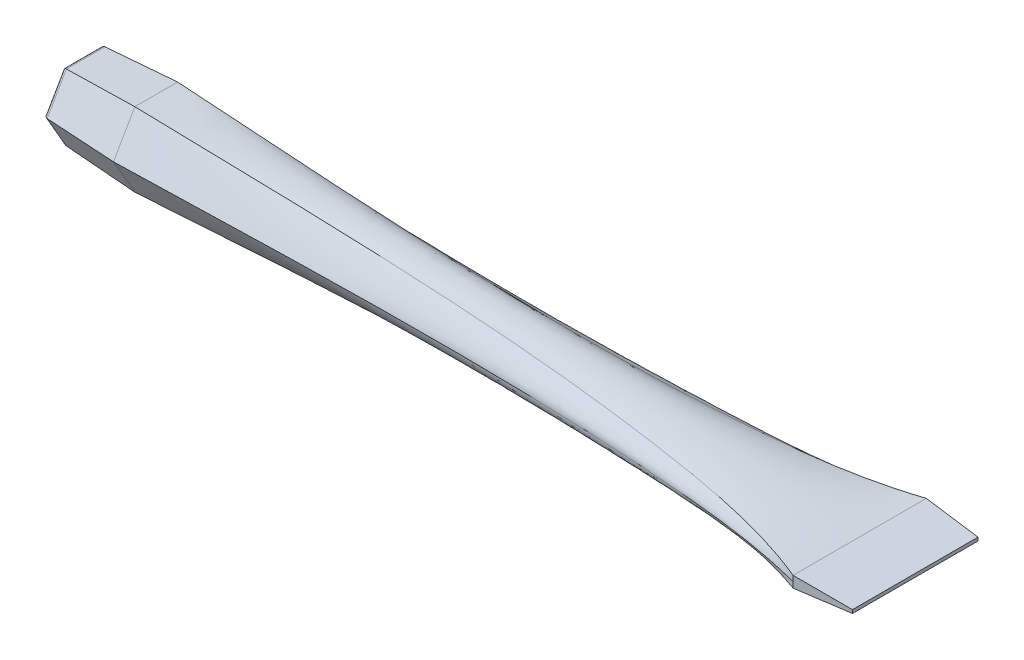
ISO-10303-21;
HEADER;
FILE_DESCRIPTION(('STEP AP214'),'2;1');
FILE_NAME('part.step','',(''),(''),'','','');
FILE_SCHEMA(('AUTOMOTIVE_DESIGN { 1 0 10303 214 1 1 1 1 }'));
ENDSEC;
DATA;
#1=APPLICATION_CONTEXT('core data for automotive mechanical design processes');
#2=APPLICATION_PROTOCOL_DEFINITION('international standard','automotive_design',2000,#1);
#3=PRODUCT_CONTEXT('',#1,'mechanical');
#4=PRODUCT('Part','Part','',(#3));
#5=PRODUCT_RELATED_PRODUCT_CATEGORY('part','',(#4));
#6=PRODUCT_DEFINITION_FORMATION('','',#4);
#7=PRODUCT_DEFINITION_CONTEXT('part definition',#1,'design');
#8=PRODUCT_DEFINITION('design','',#6,#7);
#9=PRODUCT_DEFINITION_SHAPE('','',#8);
#10=(LENGTH_UNIT() NAMED_UNIT(*) SI_UNIT(.MILLI.,.METRE.));
#11=(NAMED_UNIT(*) PLANE_ANGLE_UNIT() SI_UNIT($,.RADIAN.));
#12=(NAMED_UNIT(*) SI_UNIT($,.STERADIAN.) SOLID_ANGLE_UNIT());
#13=UNCERTAINTY_MEASURE_WITH_UNIT(LENGTH_MEASURE(1.E-05),#10,'distance_accuracy_value','');
#14=(GEOMETRIC_REPRESENTATION_CONTEXT(3) GLOBAL_UNCERTAINTY_ASSIGNED_CONTEXT((#13)) GLOBAL_UNIT_ASSIGNED_CONTEXT((#10,
#11,#12)) REPRESENTATION_CONTEXT('',''));
#15=CARTESIAN_POINT('',(0.,0.,0.));
#16=DIRECTION('',(0.,0.,1.));
#17=DIRECTION('',(1.,0.,0.));
#18=AXIS2_PLACEMENT_3D('',#15,#16,#17);
#19=CARTESIAN_POINT('',(0.,0.,11.5470053837925));
#20=CARTESIAN_POINT('',(50.0524857948005,0.,10.152627898497));
#21=CARTESIAN_POINT('',(114.191888216519,0.,7.717409430133));
#22=CARTESIAN_POINT('',(176.719152461467,0.,14.454624309302));
#23=CARTESIAN_POINT('',(190.,0.,18.));
#24=CARTESIAN_POINT('',(0.,-3.33333333333334,9.62250448649376));
#25=CARTESIAN_POINT('',(50.0807434546291,-2.58960922456807,8.34036333428904));
#26=CARTESIAN_POINT('',(114.135882131359,-1.9868860527801,8.94009763736227));
#27=CARTESIAN_POINT('',(176.747410121296,-0.700720335679182,13.9253603432932));
#28=CARTESIAN_POINT('',(190.,-0.500000000000002,18.));
#29=CARTESIAN_POINT('',(0.,-6.66666666666668,7.698003589195));
#30=CARTESIAN_POINT('',(50.1090011144577,-5.17921844913613,6.5280987700811));
#31=CARTESIAN_POINT('',(114.0798760462,-3.8493216600053,6.98155758950189));
#32=CARTESIAN_POINT('',(176.775667781124,-1.40144067135834,13.3960963772844));
#33=CARTESIAN_POINT('',(190.,-1.,18.));
#34=CARTESIAN_POINT('',(0.,-10.,5.77350269189624));
#35=CARTESIAN_POINT('',(50.1372587742863,-7.76882767370418,4.71583420587316));
#36=CARTESIAN_POINT('',(114.023869961041,-4.92835147361547,2.43953739263068));
#37=CARTESIAN_POINT('',(176.803925440953,-2.1021610070375,12.8668324112757));
#38=CARTESIAN_POINT('',(190.,-1.5,18.));
#39=B_SPLINE_SURFACE_WITH_KNOTS('',3,3,((#19,#20,#21,#22,#23),(#24,#25,#26,#27,#28),(#29,#30,
#31,#32,#33),(#34,#35,#36,#37,#38)),.UNSPECIFIED.,.F.,.F.,.F.,(4,4),(4,1,4),(0.,1.),(0.,
0.786925268887612,1.),.UNSPECIFIED.);
#40=DIRECTION('',(0.,-0.866025403784438,-0.500000000000001));
#41=VECTOR('',#40,1.);
#42=CARTESIAN_POINT('',(0.,0.,11.5470053837925));
#43=LINE('',#42,#41);
#44=CARTESIAN_POINT('',(0.,0.,11.5470053837925));
#45=VERTEX_POINT('',#44);
#46=CARTESIAN_POINT('',(0.,-10.,5.77350269189624));
#47=VERTEX_POINT('',#46);
#48=EDGE_CURVE('E188',#45,#47,#43,.T.);
#49=CARTESIAN_POINT('',(0.,-10.,5.77350269189624));
#50=CARTESIAN_POINT('',(50.1372587742863,-7.76882767370418,4.71583420587316));
#51=CARTESIAN_POINT('',(114.023869961041,-4.92835147361547,2.43953739263068));
#52=CARTESIAN_POINT('',(176.803925440953,-2.1021610070375,12.8668324112757));
#53=CARTESIAN_POINT('',(190.,-1.5,18.));
#54=B_SPLINE_CURVE_WITH_KNOTS('',3,(#49,#50,#51,#52,#53),.UNSPECIFIED.,.F.,.F.,(4,1,4),(0.,
0.786925268887612,1.),.UNSPECIFIED.);
#55=CARTESIAN_POINT('',(190.,-1.5,18.));
#56=VERTEX_POINT('',#55);
#57=EDGE_CURVE('E219',#47,#56,#54,.T.);
#58=DIRECTION('',(0.,-1.,0.));
#59=VECTOR('',#58,1.);
#60=CARTESIAN_POINT('',(190.,-1.5,18.));
#61=LINE('',#60,#59);
#62=CARTESIAN_POINT('',(190.,0.,18.));
#63=VERTEX_POINT('',#62);
#64=EDGE_CURVE('E217',#63,#56,#61,.T.);
#65=CARTESIAN_POINT('',(0.,0.,11.5470053837925));
#66=CARTESIAN_POINT('',(50.0524857948005,0.,10.152627898497));
#67=CARTESIAN_POINT('',(114.191888216519,0.,7.717409430133));
#68=CARTESIAN_POINT('',(176.719152461467,0.,14.454624309302));
#69=CARTESIAN_POINT('',(190.,0.,18.));
#70=B_SPLINE_CURVE_WITH_KNOTS('',3,(#65,#66,#67,#68,#69),.UNSPECIFIED.,.F.,.F.,(4,1,4),(0.,
0.786925268887612,1.),.UNSPECIFIED.);
#71=EDGE_CURVE('E207',#63,#45,#70,.F.);
#72=ORIENTED_EDGE('',*,*,#48,.T.);
#73=ORIENTED_EDGE('',*,*,#57,.T.);
#74=ORIENTED_EDGE('',*,*,#64,.F.);
#75=ORIENTED_EDGE('',*,*,#71,.T.);
#76=EDGE_LOOP('',(#72,#73,#74,#75));
#77=FACE_BOUND('',#76,.T.);
#78=ADVANCED_FACE('F75',(#77),#39,.T.);
#79=CARTESIAN_POINT('',(0.,-10.,5.77350269189624));
#80=CARTESIAN_POINT('',(50.1372587742863,-7.76882767370418,4.71583420587316));
#81=CARTESIAN_POINT('',(114.023869961041,-4.92835147361547,2.43953739263069));
#82=CARTESIAN_POINT('',(176.803925440953,-2.1021610070375,12.8668324112757));
#83=CARTESIAN_POINT('',(190.,-1.5,18.));
#84=CARTESIAN_POINT('',(0.,-10.,5.29237746757155));
#85=CARTESIAN_POINT('',(50.1173549026115,-7.93798023263459,4.41725436959057));
#86=CARTESIAN_POINT('',(114.063319014458,-5.3953873633319,2.58748183779831));
#87=CARTESIAN_POINT('',(176.784021569278,-2.27131356596791,11.8890027245429));
#88=CARTESIAN_POINT('',(190.,-1.5,16.5));
#89=CARTESIAN_POINT('',(0.,-10.,4.33012701892217));
#90=CARTESIAN_POINT('',(50.0775471592618,-8.2762853504954,3.8200946970254));
#91=CARTESIAN_POINT('',(114.142217121291,-6.15790110732661,2.49949383465914));
#92=CARTESIAN_POINT('',(176.744213825929,-2.60961868382872,9.93334335107729));
#93=CARTESIAN_POINT('',(190.,-1.5,13.5));
#94=CARTESIAN_POINT('',(0.,-10.,2.40562612162341));
#95=CARTESIAN_POINT('',(50.0356832500862,-8.7446797768169,2.29121854053671));
#96=CARTESIAN_POINT('',(114.225190505381,-7.35240675599341,1.87035221919841));
#97=CARTESIAN_POINT('',(176.702349916753,-3.07801311015022,5.68746779278776));
#98=CARTESIAN_POINT('',(190.,-1.5,7.5));
#99=CARTESIAN_POINT('',(0.,-9.99999999999999,0.));
#100=CARTESIAN_POINT('',(50.0186474363684,-9.00799071015255,-0.00032548337492733));
#101=CARTESIAN_POINT('',(114.258955128481,-7.98233038199574,-0.000825329718279294));
#102=CARTESIAN_POINT('',(176.685314103035,-3.34132404348587,-0.000325483374897683));
#103=CARTESIAN_POINT('',(190.,-1.5,0.));
#104=CARTESIAN_POINT('',(0.,-10.,-2.40562612162348));
#105=CARTESIAN_POINT('',(50.0356933414434,-8.74473720505391,-2.290587571826));
#106=CARTESIAN_POINT('',(114.225170504523,-7.35254870712392,-1.86873682059862));
#107=CARTESIAN_POINT('',(176.70236000811,-3.07807053838724,-5.68683682407701));
#108=CARTESIAN_POINT('',(190.,-1.5,-7.5));
#109=CARTESIAN_POINT('',(0.,-9.99999999999998,-4.33012701892224));
#110=CARTESIAN_POINT('',(50.0775459811206,-8.27629377709764,-3.82019822009271));
#111=CARTESIAN_POINT('',(114.142219456343,-6.15792748057584,-2.49982203523417));
#112=CARTESIAN_POINT('',(176.744212647787,-2.60962711043097,-9.93344687414455));
#113=CARTESIAN_POINT('',(190.,-1.5,-13.5));
#114=CARTESIAN_POINT('',(0.,-9.99999999999998,-5.29237746757162));
#115=CARTESIAN_POINT('',(50.1173545098978,-7.93798304150199,-4.4172888772797));
#116=CARTESIAN_POINT('',(114.063319792808,-5.39538179621599,-2.58741344428714));
#117=CARTESIAN_POINT('',(176.784021176564,-2.27131637483533,-11.889037232232));
#118=CARTESIAN_POINT('',(190.,-1.5,-16.5));
#119=CARTESIAN_POINT('',(0.,-9.99999999999998,-5.77350269189631));
#120=CARTESIAN_POINT('',(50.1372587742863,-7.76882767370416,-4.7158342058732));
#121=CARTESIAN_POINT('',(114.023869961041,-4.92835147361547,-2.43953739263069));
#122=CARTESIAN_POINT('',(176.803925440953,-2.10216100703751,-12.8668324112757));
#123=CARTESIAN_POINT('',(190.,-1.5,-18.));
#124=B_SPLINE_SURFACE_WITH_KNOTS('',3,3,((#79,#80,#81,#82,#83),(#84,#85,#86,#87,#88),(#89,#90,
#91,#92,#93),(#94,#95,#96,#97,#98),(#99,#100,#101,#102,#103),(#104,#105,#106,#107,#108),(#109,
#110,#111,#112,#113),(#114,#115,#116,#117,#118),(#119,#120,#121,#122,#123)),.UNSPECIFIED.,.F.,
.F.,.F.,(4,1,1,1,1,1,4),(4,1,4),(0.,0.125,0.25,0.5,0.75,0.875,1.),(0.,0.786925268887612,1.),.UNSPECIFIED.);
#125=DIRECTION('',(0.,0.,-1.));
#126=VECTOR('',#125,1.);
#127=CARTESIAN_POINT('',(0.,-10.,5.77350269189624));
#128=LINE('',#127,#126);
#129=CARTESIAN_POINT('',(0.,-9.99999999999998,-5.77350269189631));
#130=VERTEX_POINT('',#129);
#131=EDGE_CURVE('E199',#47,#130,#128,.T.);
#132=CARTESIAN_POINT('',(0.,-9.99999999999998,-5.77350269189631));
#133=CARTESIAN_POINT('',(50.1372587742863,-7.76882767370416,-4.7158342058732));
#134=CARTESIAN_POINT('',(114.023869961041,-4.92835147361547,-2.43953739263069));
#135=CARTESIAN_POINT('',(176.803925440953,-2.10216100703751,-12.8668324112757));
#136=CARTESIAN_POINT('',(190.,-1.5,-18.));
#137=B_SPLINE_CURVE_WITH_KNOTS('',3,(#132,#133,#134,#135,#136),.UNSPECIFIED.,.F.,.F.,(4,1,4),
(0.,0.786925268887612,1.),.UNSPECIFIED.);
#138=CARTESIAN_POINT('',(190.,-1.5,-18.));
#139=VERTEX_POINT('',#138);
#140=EDGE_CURVE('E222',#130,#139,#137,.T.);
#141=DIRECTION('',(0.,0.,-1.));
#142=VECTOR('',#141,1.);
#143=CARTESIAN_POINT('',(190.,-1.5,-18.));
#144=LINE('',#143,#142);
#145=EDGE_CURVE('E279',#56,#139,#144,.T.);
#146=ORIENTED_EDGE('',*,*,#131,.T.);
#147=ORIENTED_EDGE('',*,*,#140,.T.);
#148=ORIENTED_EDGE('',*,*,#145,.F.);
#149=ORIENTED_EDGE('',*,*,#57,.F.);
#150=EDGE_LOOP('',(#146,#147,#148,#149));
#151=FACE_BOUND('',#150,.T.);
#152=ADVANCED_FACE('F252',(#151),#124,.T.);
#153=CARTESIAN_POINT('',(0.,9.99999999999994,5.77350269189638));
#154=CARTESIAN_POINT('',(50.1372587742863,7.76882767370414,4.71583420587323));
#155=CARTESIAN_POINT('',(114.023869961041,4.92835147361547,2.43953739263067));
#156=CARTESIAN_POINT('',(176.803925440953,2.10216100703751,12.8668324112757));
#157=CARTESIAN_POINT('',(190.,1.5,18.));
#158=CARTESIAN_POINT('',(0.,6.66666666666663,7.69800358919509));
#159=CARTESIAN_POINT('',(50.1090011144577,5.17921844913609,6.52809877008115));
#160=CARTESIAN_POINT('',(114.0798760462,3.84932166000529,6.98155758950199));
#161=CARTESIAN_POINT('',(176.775667781124,1.40144067135833,13.3960963772844));
#162=CARTESIAN_POINT('',(190.,0.999999999999999,18.));
#163=CARTESIAN_POINT('',(0.,3.33333333333331,9.62250448649381));
#164=CARTESIAN_POINT('',(50.0807434546291,2.58960922456803,8.34036333428907));
#165=CARTESIAN_POINT('',(114.135882131359,1.98688605278004,8.94009763736238));
#166=CARTESIAN_POINT('',(176.747410121296,0.700720335679157,13.9253603432932));
#167=CARTESIAN_POINT('',(190.,0.499999999999999,18.));
#168=CARTESIAN_POINT('',(0.,0.,11.5470053837925));
#169=CARTESIAN_POINT('',(50.0524857948005,0.,10.152627898497));
#170=CARTESIAN_POINT('',(114.191888216519,0.,7.717409430133));
#171=CARTESIAN_POINT('',(176.719152461467,0.,14.454624309302));
#172=CARTESIAN_POINT('',(190.,0.,18.));
#173=B_SPLINE_SURFACE_WITH_KNOTS('',3,3,((#153,#154,#155,#156,#157),(#158,#159,#160,#161,#162),
(#163,#164,#165,#166,#167),(#168,#169,#170,#171,#172)),.UNSPECIFIED.,.F.,.F.,.F.,(4,4),(4,1,4),
(0.,1.),(0.,0.786925268887612,1.),.UNSPECIFIED.);
#174=DIRECTION('',(0.,-0.866025403784442,0.499999999999995));
#175=VECTOR('',#174,1.);
#176=CARTESIAN_POINT('',(0.,9.99999999999994,5.77350269189638));
#177=LINE('',#176,#175);
#178=CARTESIAN_POINT('',(0.,9.99999999999994,5.77350269189638));
#179=VERTEX_POINT('',#178);
#180=EDGE_CURVE('E179',#179,#45,#177,.T.);
#181=DIRECTION('',(0.,-1.,0.));
#182=VECTOR('',#181,1.);
#183=CARTESIAN_POINT('',(190.,0.,18.));
#184=LINE('',#183,#182);
#185=CARTESIAN_POINT('',(190.,1.5,18.));
#186=VERTEX_POINT('',#185);
#187=EDGE_CURVE('E425',#186,#63,#184,.T.);
#188=CARTESIAN_POINT('',(0.,9.99999999999994,5.77350269189638));
#189=CARTESIAN_POINT('',(50.1372587742863,7.76882767370414,4.71583420587323));
#190=CARTESIAN_POINT('',(114.023869961041,4.92835147361547,2.43953739263068));
#191=CARTESIAN_POINT('',(176.803925440953,2.10216100703751,12.8668324112756));
#192=CARTESIAN_POINT('',(190.,1.5,18.));
#193=B_SPLINE_CURVE_WITH_KNOTS('',3,(#188,#189,#190,#191,#192),.UNSPECIFIED.,.F.,.F.,(4,1,4),
(0.,0.786925268887612,1.),.UNSPECIFIED.);
#194=EDGE_CURVE('E210',#179,#186,#193,.T.);
#195=ORIENTED_EDGE('',*,*,#180,.T.);
#196=ORIENTED_EDGE('',*,*,#71,.F.);
#197=ORIENTED_EDGE('',*,*,#187,.F.);
#198=ORIENTED_EDGE('',*,*,#194,.F.);
#199=EDGE_LOOP('',(#195,#196,#197,#198));
#200=FACE_BOUND('',#199,.T.);
#201=ADVANCED_FACE('F206',(#200),#173,.T.);
#202=CARTESIAN_POINT('',(0.,-9.99999999999998,-5.77350269189631));
#203=CARTESIAN_POINT('',(50.1372587742863,-7.76882767370416,-4.7158342058732));
#204=CARTESIAN_POINT('',(114.023869961041,-4.92835147361547,-2.4395373926307));
#205=CARTESIAN_POINT('',(176.803925440953,-2.10216100703751,-12.8668324112757));
#206=CARTESIAN_POINT('',(190.,-1.5,-18.));
#207=CARTESIAN_POINT('',(0.,-6.66666666666663,-7.69800358919505));
#208=CARTESIAN_POINT('',(50.1090011144577,-5.17921844913609,-6.52809877008113));
#209=CARTESIAN_POINT('',(114.0798760462,-3.8493216600053,-6.98155758950194));
#210=CARTESIAN_POINT('',(176.775667781124,-1.40144067135834,-13.3960963772844));
#211=CARTESIAN_POINT('',(190.,-0.999999999999996,-18.));
#212=CARTESIAN_POINT('',(0.,-3.33333333333327,-9.62250448649378));
#213=CARTESIAN_POINT('',(50.0807434546291,-2.58960922456802,-8.34036333428906));
#214=CARTESIAN_POINT('',(114.135882131359,-1.98688605278007,-8.94009763736234));
#215=CARTESIAN_POINT('',(176.747410121296,-0.700720335679171,-13.9253603432932));
#216=CARTESIAN_POINT('',(190.,-0.499999999999996,-18.));
#217=CARTESIAN_POINT('',(0.,0.,-11.5470053837925));
#218=CARTESIAN_POINT('',(50.0524857948005,0.,-10.152627898497));
#219=CARTESIAN_POINT('',(114.191888216519,0.,-7.717409430133));
#220=CARTESIAN_POINT('',(176.719152461467,0.,-14.454624309302));
#221=CARTESIAN_POINT('',(190.,0.,-18.));
#222=B_SPLINE_SURFACE_WITH_KNOTS('',3,3,((#202,#203,#204,#205,#206),(#207,#208,#209,#210,#211),
(#212,#213,#214,#215,#216),(#217,#218,#219,#220,#221)),.UNSPECIFIED.,.F.,.F.,.F.,(4,4),(4,1,4),
(0.,1.),(0.,0.786925268887612,1.),.UNSPECIFIED.);
#223=DIRECTION('',(0.,0.866025403784441,-0.499999999999995));
#224=VECTOR('',#223,1.);
#225=CARTESIAN_POINT('',(0.,-9.99999999999998,-5.77350269189631));
#226=LINE('',#225,#224);
#227=CARTESIAN_POINT('',(0.,0.,-11.5470053837925));
#228=VERTEX_POINT('',#227);
#229=EDGE_CURVE('E759',#130,#228,#226,.T.);
#230=CARTESIAN_POINT('',(0.,0.,-11.5470053837925));
#231=CARTESIAN_POINT('',(50.0524857948005,0.,-10.152627898497));
#232=CARTESIAN_POINT('',(114.191888216519,0.,-7.717409430133));
#233=CARTESIAN_POINT('',(176.719152461467,0.,-14.454624309302));
#234=CARTESIAN_POINT('',(190.,0.,-18.));
#235=B_SPLINE_CURVE_WITH_KNOTS('',3,(#230,#231,#232,#233,#234),.UNSPECIFIED.,.F.,.F.,(4,1,4),
(0.,0.786925268887612,1.),.UNSPECIFIED.);
#236=CARTESIAN_POINT('',(190.,0.,-18.));
#237=VERTEX_POINT('',#236);
#238=EDGE_CURVE('E331',#228,#237,#235,.T.);
#239=DIRECTION('',(0.,1.,0.));
#240=VECTOR('',#239,1.);
#241=CARTESIAN_POINT('',(190.,-1.5,-18.));
#242=LINE('',#241,#240);
#243=EDGE_CURVE('E292',#139,#237,#242,.T.);
#244=ORIENTED_EDGE('',*,*,#229,.T.);
#245=ORIENTED_EDGE('',*,*,#238,.T.);
#246=ORIENTED_EDGE('',*,*,#243,.F.);
#247=ORIENTED_EDGE('',*,*,#140,.F.);
#248=EDGE_LOOP('',(#244,#245,#246,#247));
#249=FACE_BOUND('',#248,.T.);
#250=ADVANCED_FACE('F299',(#249),#222,.T.);
#251=CARTESIAN_POINT('',(0.,0.,-11.5470053837925));
#252=CARTESIAN_POINT('',(50.0524857948005,0.,-10.152627898497));
#253=CARTESIAN_POINT('',(114.191888216519,0.,-7.717409430133));
#254=CARTESIAN_POINT('',(176.719152461467,0.,-14.454624309302));
#255=CARTESIAN_POINT('',(190.,0.,-18.));
#256=CARTESIAN_POINT('',(0.,3.33333333333341,-9.62250448649374));
#257=CARTESIAN_POINT('',(50.0807434546291,2.5896092245681,-8.34036333428903));
#258=CARTESIAN_POINT('',(114.135882131359,1.98688605278007,-8.94009763736233));
#259=CARTESIAN_POINT('',(176.747410121296,0.700720335679165,-13.9253603432932));
#260=CARTESIAN_POINT('',(190.,0.500000000000004,-18.));
#261=CARTESIAN_POINT('',(0.,6.66666666666673,-7.69800358919495));
#262=CARTESIAN_POINT('',(50.1090011144577,5.17921844913615,-6.52809877008107));
#263=CARTESIAN_POINT('',(114.0798760462,3.8493216600053,-6.98155758950194));
#264=CARTESIAN_POINT('',(176.775667781124,1.40144067135833,-13.3960963772844));
#265=CARTESIAN_POINT('',(190.,1.,-18.));
#266=CARTESIAN_POINT('',(0.,10.0000000000001,-5.77350269189617));
#267=CARTESIAN_POINT('',(50.1372587742863,7.76882767370421,-4.71583420587311));
#268=CARTESIAN_POINT('',(114.023869961041,4.92835147361547,-2.43953739263068));
#269=CARTESIAN_POINT('',(176.803925440953,2.1021610070375,-12.8668324112757));
#270=CARTESIAN_POINT('',(190.,1.5,-18.));
#271=B_SPLINE_SURFACE_WITH_KNOTS('',3,3,((#251,#252,#253,#254,#255),(#256,#257,#258,#259,#260),
(#261,#262,#263,#264,#265),(#266,#267,#268,#269,#270)),.UNSPECIFIED.,.F.,.F.,.F.,(4,4),(4,1,4),
(0.,1.),(0.,0.786925268887612,1.),.UNSPECIFIED.);
#272=DIRECTION('',(0.,0.866025403784435,0.500000000000007));
#273=VECTOR('',#272,1.);
#274=CARTESIAN_POINT('',(0.,0.,-11.5470053837925));
#275=LINE('',#274,#273);
#276=CARTESIAN_POINT('',(0.,10.0000000000001,-5.77350269189617));
#277=VERTEX_POINT('',#276);
#278=EDGE_CURVE('E224',#228,#277,#275,.T.);
#279=CARTESIAN_POINT('',(0.,10.0000000000001,-5.77350269189617));
#280=CARTESIAN_POINT('',(50.1372587742863,7.76882767370421,-4.71583420587311));
#281=CARTESIAN_POINT('',(114.023869961041,4.92835147361547,-2.43953739263068));
#282=CARTESIAN_POINT('',(176.803925440953,2.1021610070375,-12.8668324112757));
#283=CARTESIAN_POINT('',(190.,1.5,-18.));
#284=B_SPLINE_CURVE_WITH_KNOTS('',3,(#279,#280,#281,#282,#283),.UNSPECIFIED.,.F.,.F.,(4,1,4),
(0.,0.786925268887612,1.),.UNSPECIFIED.);
#285=CARTESIAN_POINT('',(190.,1.5,-18.));
#286=VERTEX_POINT('',#285);
#287=EDGE_CURVE('E338',#277,#286,#284,.T.);
#288=DIRECTION('',(0.,1.,0.));
#289=VECTOR('',#288,1.);
#290=CARTESIAN_POINT('',(190.,0.,-18.));
#291=LINE('',#290,#289);
#292=EDGE_CURVE('E363',#237,#286,#291,.T.);
#293=ORIENTED_EDGE('',*,*,#278,.T.);
#294=ORIENTED_EDGE('',*,*,#287,.T.);
#295=ORIENTED_EDGE('',*,*,#292,.F.);
#296=ORIENTED_EDGE('',*,*,#238,.F.);
#297=EDGE_LOOP('',(#293,#294,#295,#296));
#298=FACE_BOUND('',#297,.T.);
#299=ADVANCED_FACE('F310',(#298),#271,.T.);
#300=CARTESIAN_POINT('',(0.,10.0000000000001,-5.77350269189617));
#301=CARTESIAN_POINT('',(50.1372587742863,7.76882767370421,-4.71583420587311));
#302=CARTESIAN_POINT('',(114.023869961041,4.92835147361547,-2.43953739263069));
#303=CARTESIAN_POINT('',(176.803925440953,2.1021610070375,-12.8668324112757));
#304=CARTESIAN_POINT('',(190.,1.5,-18.));
#305=CARTESIAN_POINT('',(0.,10.0000000000001,-5.29237746757148));
#306=CARTESIAN_POINT('',(50.1173549026115,7.93798023263461,-4.41725436959053));
#307=CARTESIAN_POINT('',(114.063319014458,5.3953873633319,-2.58748183779831));
#308=CARTESIAN_POINT('',(176.784021569278,2.27131356596791,-11.8890027245429));
#309=CARTESIAN_POINT('',(190.,1.5,-16.5));
#310=CARTESIAN_POINT('',(0.,10.,-4.3301270189221));
#311=CARTESIAN_POINT('',(50.0775471592618,8.27628535049543,-3.82009469702535));
#312=CARTESIAN_POINT('',(114.142217121292,6.15790110732663,-2.49949383465917));
#313=CARTESIAN_POINT('',(176.744213825929,2.60961868382873,-9.93334335107728));
#314=CARTESIAN_POINT('',(190.,1.5,-13.5));
#315=CARTESIAN_POINT('',(0.,10.,-2.40562612162334));
#316=CARTESIAN_POINT('',(50.0356832500862,8.74467977681689,-2.29121854053667));
#317=CARTESIAN_POINT('',(114.22519050538,7.35240675599339,-1.87035221919838));
#318=CARTESIAN_POINT('',(176.702349916753,3.07801311015021,-5.68746779278778));
#319=CARTESIAN_POINT('',(190.,1.5,-7.49999999999999));
#320=CARTESIAN_POINT('',(0.,10.,1.02348685082632E-13));
#321=CARTESIAN_POINT('',(50.0186474363684,9.00799071015255,0.000325483374969926));
#322=CARTESIAN_POINT('',(114.258955128481,7.98233038199576,0.000825329718274401));
#323=CARTESIAN_POINT('',(176.685314103035,3.34132404348589,0.000325483374907015));
#324=CARTESIAN_POINT('',(190.,1.5,0.));
#325=CARTESIAN_POINT('',(0.,9.99999999999998,2.40562612162355));
#326=CARTESIAN_POINT('',(50.0356933414434,8.74473720505389,2.29058757182603));
#327=CARTESIAN_POINT('',(114.225170504523,7.3525487071239,1.86873682059858));
#328=CARTESIAN_POINT('',(176.70236000811,3.07807053838724,5.686836824077));
#329=CARTESIAN_POINT('',(190.,1.5,7.50000000000001));
#330=CARTESIAN_POINT('',(0.,9.99999999999995,4.33012701892231));
#331=CARTESIAN_POINT('',(50.0775459811206,8.27629377709761,3.82019822009275));
#332=CARTESIAN_POINT('',(114.142219456342,6.15792748057586,2.49982203523412));
#333=CARTESIAN_POINT('',(176.744212647787,2.60962711043098,9.93344687414457));
#334=CARTESIAN_POINT('',(190.,1.5,13.5));
#335=CARTESIAN_POINT('',(0.,9.99999999999994,5.29237746757169));
#336=CARTESIAN_POINT('',(50.1173545098978,7.93798304150196,4.41728887727974));
#337=CARTESIAN_POINT('',(114.063319792808,5.39538179621599,2.58741344428713));
#338=CARTESIAN_POINT('',(176.784021176564,2.27131637483533,11.8890372322319));
#339=CARTESIAN_POINT('',(190.,1.5,16.5));
#340=CARTESIAN_POINT('',(0.,9.99999999999994,5.77350269189638));
#341=CARTESIAN_POINT('',(50.1372587742863,7.76882767370414,4.71583420587323));
#342=CARTESIAN_POINT('',(114.023869961041,4.92835147361547,2.43953739263068));
#343=CARTESIAN_POINT('',(176.803925440953,2.10216100703751,12.8668324112756));
#344=CARTESIAN_POINT('',(190.,1.5,18.));
#345=B_SPLINE_SURFACE_WITH_KNOTS('',3,3,((#300,#301,#302,#303,#304),(#305,#306,#307,#308,#309),
(#310,#311,#312,#313,#314),(#315,#316,#317,#318,#319),(#320,#321,#322,#323,#324),(#325,#326,
#327,#328,#329),(#330,#331,#332,#333,#334),(#335,#336,#337,#338,#339),(#340,#341,#342,#343,
#344)),.UNSPECIFIED.,.F.,.F.,.F.,(4,1,1,1,1,1,4),(4,1,4),(0.,0.125,0.25,0.5,0.75,0.875,1.),(0.,
0.786925268887612,1.),.UNSPECIFIED.);
#346=DIRECTION('',(0.,0.,1.));
#347=VECTOR('',#346,1.);
#348=CARTESIAN_POINT('',(0.,10.0000000000001,-5.77350269189617));
#349=LINE('',#348,#347);
#350=EDGE_CURVE('E220',#277,#179,#349,.T.);
#351=DIRECTION('',(0.,0.,1.));
#352=VECTOR('',#351,1.);
#353=CARTESIAN_POINT('',(190.,1.5,-18.));
#354=LINE('',#353,#352);
#355=EDGE_CURVE('E376',#286,#186,#354,.T.);
#356=ORIENTED_EDGE('',*,*,#350,.T.);
#357=ORIENTED_EDGE('',*,*,#194,.T.);
#358=ORIENTED_EDGE('',*,*,#355,.F.);
#359=ORIENTED_EDGE('',*,*,#287,.F.);
#360=EDGE_LOOP('',(#356,#357,#358,#359));
#361=FACE_BOUND('',#360,.T.);
#362=ADVANCED_FACE('F380',(#361),#345,.T.);
#363=CARTESIAN_POINT('',(190.,1.5,-18.));
#364=DIRECTION('',(0.0697564737441255,0.997564050259824,0.));
#365=DIRECTION('',(-0.997564050259824,0.0697564737441255,0.));
#366=AXIS2_PLACEMENT_3D('',#363,#364,#365);
#367=PLANE('',#366);
#368=ORIENTED_EDGE('',*,*,#355,.T.);
#369=DIRECTION('',(-0.995145815783508,0.0695873743166648,0.0695873743166648));
#370=VECTOR('',#369,1.);
#371=CARTESIAN_POINT('',(190.103874376574,1.49273639600357,17.9927363960036));
#372=LINE('',#371,#370);
#373=CARTESIAN_POINT('',(205.,0.451097820847341,16.9510978208473));
#374=VERTEX_POINT('',#373);
#375=EDGE_CURVE('E457',#374,#186,#372,.T.);
#376=ORIENTED_EDGE('',*,*,#375,.F.);
#377=DIRECTION('',(0.,0.,-1.));
#378=VECTOR('',#377,1.);
#379=CARTESIAN_POINT('',(205.,0.451097820847345,-18.));
#380=LINE('',#379,#378);
#381=CARTESIAN_POINT('',(205.,0.451097820847345,-16.9510978208473));
#382=VERTEX_POINT('',#381);
#383=EDGE_CURVE('E530',#382,#374,#380,.F.);
#384=ORIENTED_EDGE('',*,*,#383,.F.);
#385=DIRECTION('',(-0.995145815783508,0.0695873743166648,-0.0695873743166648));
#386=VECTOR('',#385,1.);
#387=CARTESIAN_POINT('',(190.,1.5,-18.));
#388=LINE('',#387,#386);
#389=EDGE_CURVE('E212',#382,#286,#388,.T.);
#390=ORIENTED_EDGE('',*,*,#389,.T.);
#391=EDGE_LOOP('',(#368,#376,#384,#390));
#392=FACE_BOUND('',#391,.T.);
#393=ADVANCED_FACE('F391',(#392),#367,.T.);
#394=CARTESIAN_POINT('',(190.,0.,18.));
#395=DIRECTION('',(0.0697564737441255,0.,0.997564050259824));
#396=DIRECTION('',(0.997564050259824,0.,-0.0697564737441255));
#397=AXIS2_PLACEMENT_3D('',#394,#395,#396);
#398=PLANE('',#397);
#399=ORIENTED_EDGE('',*,*,#187,.T.);
#400=ORIENTED_EDGE('',*,*,#64,.T.);
#401=DIRECTION('',(-0.995145815783508,-0.0695873743166648,0.0695873743166648));
#402=VECTOR('',#401,1.);
#403=CARTESIAN_POINT('',(190.,-1.5,18.));
#404=LINE('',#403,#402);
#405=CARTESIAN_POINT('',(205.,-0.451097820847343,16.9510978208473));
#406=VERTEX_POINT('',#405);
#407=EDGE_CURVE('E454',#406,#56,#404,.T.);
#408=ORIENTED_EDGE('',*,*,#407,.F.);
#409=DIRECTION('',(0.,1.,0.));
#410=VECTOR('',#409,1.);
#411=CARTESIAN_POINT('',(205.,0.,16.9510978208473));
#412=LINE('',#411,#410);
#413=EDGE_CURVE('E532',#374,#406,#412,.F.);
#414=ORIENTED_EDGE('',*,*,#413,.F.);
#415=ORIENTED_EDGE('',*,*,#375,.T.);
#416=EDGE_LOOP('',(#399,#400,#408,#414,#415));
#417=FACE_BOUND('',#416,.T.);
#418=ADVANCED_FACE('F253',(#417),#398,.T.);
#419=CARTESIAN_POINT('',(190.,-1.5,18.));
#420=DIRECTION('',(0.0697564737441255,-0.997564050259824,0.));
#421=DIRECTION('',(0.997564050259824,0.0697564737441255,0.));
#422=AXIS2_PLACEMENT_3D('',#419,#420,#421);
#423=PLANE('',#422);
#424=ORIENTED_EDGE('',*,*,#145,.T.);
#425=DIRECTION('',(-0.995145815783508,-0.0695873743166648,-0.0695873743166648));
#426=VECTOR('',#425,1.);
#427=CARTESIAN_POINT('',(190.,-1.5,-18.));
#428=LINE('',#427,#426);
#429=CARTESIAN_POINT('',(205.,-0.451097820847337,-16.9510978208473));
#430=VERTEX_POINT('',#429);
#431=EDGE_CURVE('E458',#430,#139,#428,.T.);
#432=ORIENTED_EDGE('',*,*,#431,.F.);
#433=DIRECTION('',(0.,0.,1.));
#434=VECTOR('',#433,1.);
#435=CARTESIAN_POINT('',(205.,-0.451097820847343,18.));
#436=LINE('',#435,#434);
#437=EDGE_CURVE('E522',#406,#430,#436,.F.);
#438=ORIENTED_EDGE('',*,*,#437,.F.);
#439=ORIENTED_EDGE('',*,*,#407,.T.);
#440=EDGE_LOOP('',(#424,#432,#438,#439));
#441=FACE_BOUND('',#440,.T.);
#442=ADVANCED_FACE('F505',(#441),#423,.T.);
#443=CARTESIAN_POINT('',(190.,-1.5,-18.));
#444=DIRECTION('',(0.0697564737441255,0.,-0.997564050259824));
#445=DIRECTION('',(-0.997564050259824,0.,-0.0697564737441255));
#446=AXIS2_PLACEMENT_3D('',#443,#444,#445);
#447=PLANE('',#446);
#448=ORIENTED_EDGE('',*,*,#243,.T.);
#449=ORIENTED_EDGE('',*,*,#292,.T.);
#450=ORIENTED_EDGE('',*,*,#389,.F.);
#451=DIRECTION('',(0.,-1.,0.));
#452=VECTOR('',#451,1.);
#453=CARTESIAN_POINT('',(205.,-1.5,-16.9510978208473));
#454=LINE('',#453,#452);
#455=EDGE_CURVE('E184',#430,#382,#454,.F.);
#456=ORIENTED_EDGE('',*,*,#455,.F.);
#457=ORIENTED_EDGE('',*,*,#431,.T.);
#458=EDGE_LOOP('',(#448,#449,#450,#456,#457));
#459=FACE_BOUND('',#458,.T.);
#460=ADVANCED_FACE('F496',(#459),#447,.T.);
#461=CARTESIAN_POINT('',(205.,0.,0.));
#462=DIRECTION('',(1.,0.,0.));
#463=DIRECTION('',(0.,0.,-1.));
#464=AXIS2_PLACEMENT_3D('',#461,#462,#463);
#465=PLANE('',#464);
#466=ORIENTED_EDGE('',*,*,#455,.T.);
#467=ORIENTED_EDGE('',*,*,#383,.T.);
#468=ORIENTED_EDGE('',*,*,#413,.T.);
#469=ORIENTED_EDGE('',*,*,#437,.T.);
#470=EDGE_LOOP('',(#466,#467,#468,#469));
#471=FACE_BOUND('',#470,.T.);
#472=ADVANCED_FACE('F504',(#471),#465,.T.);
#473=CARTESIAN_POINT('',(0.,-10.,5.77350269189624));
#474=DIRECTION('',(-0.0523359562429439,-0.499314767377288,0.864838546066895));
#475=DIRECTION('',(0.,-0.866025403784438,-0.500000000000001));
#476=AXIS2_PLACEMENT_3D('',#473,#474,#475);
#477=PLANE('',#476);
#478=DIRECTION('',(0.99817396359918,0.,0.0604047878293016));
#479=VECTOR('',#478,1.);
#480=CARTESIAN_POINT('',(0.,0.,11.5470053837925));
#481=LINE('',#480,#479);
#482=CARTESIAN_POINT('',(-19.0523359562429,0.,10.3940477300588));
#483=VERTEX_POINT('',#482);
#484=EDGE_CURVE('E175',#483,#45,#481,.T.);
#485=ORIENTED_EDGE('',*,*,#484,.F.);
#486=DIRECTION('',(0.,0.866025403784438,0.500000000000001));
#487=VECTOR('',#486,1.);
#488=CARTESIAN_POINT('',(-19.0523359562429,-8.97667689835904,5.21136090636287));
#489=LINE('',#488,#487);
#490=CARTESIAN_POINT('',(-19.0523359562429,-9.00150938237889,5.19702386502936));
#491=VERTEX_POINT('',#490);
#492=EDGE_CURVE('E12',#483,#491,#489,.F.);
#493=ORIENTED_EDGE('',*,*,#492,.T.);
#494=DIRECTION('',(0.99817396359918,-0.0523120807703845,0.0302023939146507));
#495=VECTOR('',#494,1.);
#496=CARTESIAN_POINT('',(0.,-10.,5.77350269189624));
#497=LINE('',#496,#495);
#498=EDGE_CURVE('E192',#491,#47,#497,.T.);
#499=ORIENTED_EDGE('',*,*,#498,.T.);
#500=ORIENTED_EDGE('',*,*,#48,.F.);
#501=EDGE_LOOP('',(#485,#493,#499,#500));
#502=FACE_BOUND('',#501,.T.);
#503=ADVANCED_FACE('F190',(#502),#477,.T.);
#504=CARTESIAN_POINT('',(0.,0.,11.5470053837925));
#505=DIRECTION('',(-0.0523359562429439,0.499314767377282,0.864838546066899));
#506=DIRECTION('',(0.,-0.866025403784441,0.499999999999995));
#507=AXIS2_PLACEMENT_3D('',#504,#505,#506);
#508=PLANE('',#507);
#509=DIRECTION('',(0.99817396359918,0.052312080770384,0.0302023939146512));
#510=VECTOR('',#509,1.);
#511=CARTESIAN_POINT('',(0.,9.99999999999994,5.77350269189638));
#512=LINE('',#511,#510);
#513=CARTESIAN_POINT('',(-19.0523359562429,9.00150938237881,5.1970238650295));
#514=VERTEX_POINT('',#513);
#515=EDGE_CURVE('E185',#514,#179,#512,.T.);
#516=ORIENTED_EDGE('',*,*,#515,.F.);
#517=DIRECTION('',(0.,0.866025403784442,-0.499999999999995));
#518=VECTOR('',#517,1.);
#519=CARTESIAN_POINT('',(-19.0523359562429,0.0248324840198509,10.3797106887253));
#520=LINE('',#519,#518);
#521=EDGE_CURVE('E84',#514,#483,#520,.F.);
#522=ORIENTED_EDGE('',*,*,#521,.T.);
#523=ORIENTED_EDGE('',*,*,#484,.T.);
#524=ORIENTED_EDGE('',*,*,#180,.F.);
#525=EDGE_LOOP('',(#516,#522,#523,#524));
#526=FACE_BOUND('',#525,.T.);
#527=ADVANCED_FACE('F177',(#526),#508,.T.);
#528=CARTESIAN_POINT('',(0.,9.99999999999994,5.77350269189638));
#529=DIRECTION('',(-0.0523359562429439,0.998629534754574,0.));
#530=DIRECTION('',(-0.998629534754574,-0.052335956242944,0.));
#531=AXIS2_PLACEMENT_3D('',#528,#529,#530);
#532=PLANE('',#531);
#533=DIRECTION('',(0.99817396359918,0.0523120807703847,-0.0302023939146504));
#534=VECTOR('',#533,1.);
#535=CARTESIAN_POINT('',(0.,10.0000000000001,-5.77350269189617));
#536=LINE('',#535,#534);
#537=CARTESIAN_POINT('',(-19.0523359562429,9.00150938237892,-5.1970238650293));
#538=VERTEX_POINT('',#537);
#539=EDGE_CURVE('E764',#538,#277,#536,.T.);
#540=ORIENTED_EDGE('',*,*,#539,.F.);
#541=DIRECTION('',(0.,0.,-1.));
#542=VECTOR('',#541,1.);
#543=CARTESIAN_POINT('',(-19.0523359562429,9.00150938237881,5.16834978236248));
#544=LINE('',#543,#542);
#545=EDGE_CURVE('E99',#538,#514,#544,.F.);
#546=ORIENTED_EDGE('',*,*,#545,.T.);
#547=ORIENTED_EDGE('',*,*,#515,.T.);
#548=ORIENTED_EDGE('',*,*,#350,.F.);
#549=EDGE_LOOP('',(#540,#546,#547,#548));
#550=FACE_BOUND('',#549,.T.);
#551=ADVANCED_FACE('F625',(#550),#532,.T.);
#552=CARTESIAN_POINT('',(0.,10.0000000000001,-5.77350269189617));
#553=DIRECTION('',(-0.0523359562429439,0.499314767377294,-0.864838546066892));
#554=DIRECTION('',(0.,0.866025403784435,0.500000000000007));
#555=AXIS2_PLACEMENT_3D('',#552,#553,#554);
#556=PLANE('',#555);
#557=DIRECTION('',(0.99817396359918,0.,-0.0604047878293017));
#558=VECTOR('',#557,1.);
#559=CARTESIAN_POINT('',(0.,0.,-11.5470053837925));
#560=LINE('',#559,#558);
#561=CARTESIAN_POINT('',(-19.0523359562429,0.,-10.3940477300588));
#562=VERTEX_POINT('',#561);
#563=EDGE_CURVE('E762',#562,#228,#560,.T.);
#564=ORIENTED_EDGE('',*,*,#563,.F.);
#565=DIRECTION('',(0.,-0.866025403784435,-0.500000000000007));
#566=VECTOR('',#565,1.);
#567=CARTESIAN_POINT('',(-19.0523359562429,8.97667689835907,-5.21136090636281));
#568=LINE('',#567,#566);
#569=EDGE_CURVE('E754',#562,#538,#568,.F.);
#570=ORIENTED_EDGE('',*,*,#569,.T.);
#571=ORIENTED_EDGE('',*,*,#539,.T.);
#572=ORIENTED_EDGE('',*,*,#278,.F.);
#573=EDGE_LOOP('',(#564,#570,#571,#572));
#574=FACE_BOUND('',#573,.T.);
#575=ADVANCED_FACE('F632',(#574),#556,.T.);
#576=CARTESIAN_POINT('',(0.,0.,-11.5470053837925));
#577=DIRECTION('',(-0.0523359562429439,-0.499314767377282,-0.864838546066899));
#578=DIRECTION('',(0.,0.866025403784441,-0.499999999999995));
#579=AXIS2_PLACEMENT_3D('',#576,#577,#578);
#580=PLANE('',#579);
#581=DIRECTION('',(0.99817396359918,-0.0523120807703842,-0.0302023939146511));
#582=VECTOR('',#581,1.);
#583=CARTESIAN_POINT('',(0.,-9.99999999999998,-5.77350269189631));
#584=LINE('',#583,#582);
#585=CARTESIAN_POINT('',(-19.0523359562429,-9.00150938237885,-5.19702386502943));
#586=VERTEX_POINT('',#585);
#587=EDGE_CURVE('E756',#586,#130,#584,.T.);
#588=ORIENTED_EDGE('',*,*,#587,.F.);
#589=DIRECTION('',(0.,-0.866025403784442,0.499999999999995));
#590=VECTOR('',#589,1.);
#591=CARTESIAN_POINT('',(-19.0523359562429,-0.0248324840197761,-10.3797106887253));
#592=LINE('',#591,#590);
#593=EDGE_CURVE('E749',#586,#562,#592,.F.);
#594=ORIENTED_EDGE('',*,*,#593,.T.);
#595=ORIENTED_EDGE('',*,*,#563,.T.);
#596=ORIENTED_EDGE('',*,*,#229,.F.);
#597=EDGE_LOOP('',(#588,#594,#595,#596));
#598=FACE_BOUND('',#597,.T.);
#599=ADVANCED_FACE('F639',(#598),#580,.T.);
#600=CARTESIAN_POINT('',(0.,-9.99999999999998,-5.77350269189631));
#601=DIRECTION('',(-0.0523359562429439,-0.998629534754574,0.));
#602=DIRECTION('',(0.998629534754574,-0.052335956242944,0.));
#603=AXIS2_PLACEMENT_3D('',#600,#601,#602);
#604=PLANE('',#603);
#605=ORIENTED_EDGE('',*,*,#498,.F.);
#606=DIRECTION('',(0.,0.,1.));
#607=VECTOR('',#606,1.);
#608=CARTESIAN_POINT('',(-19.0523359562429,-9.00150938237885,-5.16834978236241));
#609=LINE('',#608,#607);
#610=EDGE_CURVE('E740',#491,#586,#609,.F.);
#611=ORIENTED_EDGE('',*,*,#610,.T.);
#612=ORIENTED_EDGE('',*,*,#587,.T.);
#613=ORIENTED_EDGE('',*,*,#131,.F.);
#614=EDGE_LOOP('',(#605,#611,#612,#613));
#615=FACE_BOUND('',#614,.T.);
#616=ADVANCED_FACE('F647',(#615),#604,.T.);
#617=CARTESIAN_POINT('',(-20.,0.,0.));
#618=DIRECTION('',(-1.,0.,0.));
#619=DIRECTION('',(0.,0.,1.));
#620=AXIS2_PLACEMENT_3D('',#617,#618,#619);
#621=PLANE('',#620);
#622=DIRECTION('',(0.,0.866025403784441,-0.499999999999995));
#623=VECTOR('',#622,1.);
#624=CARTESIAN_POINT('',(-20.,-8.47736213098172,-4.34652236029603));
#625=LINE('',#624,#623);
#626=CARTESIAN_POINT('',(-20.,0.,-9.24092966863624));
#627=VERTEX_POINT('',#626);
#628=CARTESIAN_POINT('',(-20.,-8.00287984762428,-4.62046483431816));
#629=VERTEX_POINT('',#628);
#630=EDGE_CURVE('E796',#627,#629,#625,.F.);
#631=ORIENTED_EDGE('',*,*,#630,.T.);
#632=DIRECTION('',(0.,0.,-1.));
#633=VECTOR('',#632,1.);
#634=CARTESIAN_POINT('',(-20.,-8.00287984762431,5.16834978236235));
#635=LINE('',#634,#633);
#636=CARTESIAN_POINT('',(-20.,-8.00287984762431,4.6204648343181));
#637=VERTEX_POINT('',#636);
#638=EDGE_CURVE('E743',#629,#637,#635,.F.);
#639=ORIENTED_EDGE('',*,*,#638,.T.);
#640=DIRECTION('',(0.,-0.866025403784438,-0.500000000000001));
#641=VECTOR('',#640,1.);
#642=CARTESIAN_POINT('',(-20.,0.474482283357444,9.51487214265837));
#643=LINE('',#642,#641);
#644=CARTESIAN_POINT('',(-20.,0.,9.24092966863625));
#645=VERTEX_POINT('',#644);
#646=EDGE_CURVE('E788',#637,#645,#643,.F.);
#647=ORIENTED_EDGE('',*,*,#646,.T.);
#648=DIRECTION('',(0.,-0.866025403784441,0.499999999999995));
#649=VECTOR('',#648,1.);
#650=CARTESIAN_POINT('',(-20.,8.47736213098168,4.3465223602961));
#651=LINE('',#650,#649);
#652=CARTESIAN_POINT('',(-20.,8.00287984762425,4.62046483431822));
#653=VERTEX_POINT('',#652);
#654=EDGE_CURVE('E790',#645,#653,#651,.F.);
#655=ORIENTED_EDGE('',*,*,#654,.T.);
#656=DIRECTION('',(0.,0.,1.));
#657=VECTOR('',#656,1.);
#658=CARTESIAN_POINT('',(-20.,8.00287984762435,-5.1683497823623));
#659=LINE('',#658,#657);
#660=CARTESIAN_POINT('',(-20.,8.00287984762434,-4.62046483431805));
#661=VERTEX_POINT('',#660);
#662=EDGE_CURVE('E792',#653,#661,#659,.F.);
#663=ORIENTED_EDGE('',*,*,#662,.T.);
#664=DIRECTION('',(0.,0.866025403784435,0.500000000000007));
#665=VECTOR('',#664,1.);
#666=CARTESIAN_POINT('',(-20.,-0.474482283357376,-9.51487214265837));
#667=LINE('',#666,#665);
#668=EDGE_CURVE('E794',#661,#627,#667,.F.);
#669=ORIENTED_EDGE('',*,*,#668,.T.);
#670=EDGE_LOOP('',(#631,#639,#647,#655,#663,#669));
#671=FACE_BOUND('',#670,.T.);
#672=ADVANCED_FACE('F655',(#671),#621,.T.);
#673=CARTESIAN_POINT('',(-19.,8.00287984762429,0.));
#674=DIRECTION('',(0.,0.,-1.));
#675=DIRECTION('',(0.,1.,0.));
#676=AXIS2_PLACEMENT_3D('',#673,#674,#675);
#677=CYLINDRICAL_SURFACE('',#676,1.);
#678=CARTESIAN_POINT('',(-19.,8.00287984762425,4.62046483431822));
#679=DIRECTION('',(0.,0.500000000000007,-0.866025403784435));
#680=DIRECTION('',(0.,0.866025403784435,0.500000000000007));
#681=AXIS2_PLACEMENT_3D('',#678,#679,#680);
#682=ELLIPSE('',#681,1.15470053837925,1.);
#683=EDGE_CURVE('E804',#514,#653,#682,.F.);
#684=ORIENTED_EDGE('',*,*,#683,.F.);
#685=ORIENTED_EDGE('',*,*,#545,.F.);
#686=CARTESIAN_POINT('',(-19.,8.00287984762434,-4.62046483431804));
#687=DIRECTION('',(0.,-0.499999999999992,-0.866025403784443));
#688=DIRECTION('',(0.,0.866025403784443,-0.499999999999992));
#689=AXIS2_PLACEMENT_3D('',#686,#687,#688);
#690=ELLIPSE('',#689,1.15470053837925,1.);
#691=EDGE_CURVE('E79',#661,#538,#690,.T.);
#692=ORIENTED_EDGE('',*,*,#691,.F.);
#693=ORIENTED_EDGE('',*,*,#662,.F.);
#694=EDGE_LOOP('',(#684,#685,#692,#693));
#695=FACE_BOUND('',#694,.T.);
#696=ADVANCED_FACE('F77',(#695),#677,.T.);
#697=CARTESIAN_POINT('',(-19.,4.0014399238122,-6.93069725147714));
#698=DIRECTION('',(0.,-0.866025403784435,-0.500000000000007));
#699=DIRECTION('',(0.,0.500000000000007,-0.866025403784435));
#700=AXIS2_PLACEMENT_3D('',#697,#698,#699);
#701=CYLINDRICAL_SURFACE('',#700,1.);
#702=ORIENTED_EDGE('',*,*,#691,.T.);
#703=ORIENTED_EDGE('',*,*,#569,.F.);
#704=CARTESIAN_POINT('',(-19.,0.,-9.24092966863624));
#705=DIRECTION('',(0.,-1.,0.));
#706=DIRECTION('',(0.,0.,-1.));
#707=AXIS2_PLACEMENT_3D('',#704,#705,#706);
#708=ELLIPSE('',#707,1.15470053837925,1.);
#709=EDGE_CURVE('E751',#627,#562,#708,.T.);
#710=ORIENTED_EDGE('',*,*,#709,.F.);
#711=ORIENTED_EDGE('',*,*,#668,.F.);
#712=EDGE_LOOP('',(#702,#703,#710,#711));
#713=FACE_BOUND('',#712,.T.);
#714=ADVANCED_FACE('F670',(#713),#701,.T.);
#715=CARTESIAN_POINT('',(-19.,4.00143992381213,6.93069725147723));
#716=DIRECTION('',(0.,0.866025403784441,-0.499999999999995));
#717=DIRECTION('',(0.,0.499999999999995,0.866025403784442));
#718=AXIS2_PLACEMENT_3D('',#715,#716,#717);
#719=CYLINDRICAL_SURFACE('',#718,1.);
#720=ORIENTED_EDGE('',*,*,#683,.T.);
#721=ORIENTED_EDGE('',*,*,#654,.F.);
#722=CARTESIAN_POINT('',(-19.,0.,9.24092966863625));
#723=DIRECTION('',(0.,1.,0.));
#724=DIRECTION('',(0.,0.,1.));
#725=AXIS2_PLACEMENT_3D('',#722,#723,#724);
#726=ELLIPSE('',#725,1.15470053837925,1.);
#727=EDGE_CURVE('E745',#483,#645,#726,.F.);
#728=ORIENTED_EDGE('',*,*,#727,.F.);
#729=ORIENTED_EDGE('',*,*,#521,.F.);
#730=EDGE_LOOP('',(#720,#721,#728,#729));
#731=FACE_BOUND('',#730,.T.);
#732=ADVANCED_FACE('F677',(#731),#719,.T.);
#733=CARTESIAN_POINT('',(-19.,-4.00143992381211,-6.9306972514772));
#734=DIRECTION('',(0.,-0.866025403784441,0.499999999999995));
#735=DIRECTION('',(0.,-0.499999999999995,-0.866025403784441));
#736=AXIS2_PLACEMENT_3D('',#733,#734,#735);
#737=CYLINDRICAL_SURFACE('',#736,1.);
#738=ORIENTED_EDGE('',*,*,#709,.T.);
#739=ORIENTED_EDGE('',*,*,#593,.F.);
#740=CARTESIAN_POINT('',(-19.,-8.00287984762428,-4.62046483431816));
#741=DIRECTION('',(0.,-0.500000000000004,0.866025403784436));
#742=DIRECTION('',(0.,-0.866025403784436,-0.500000000000004));
#743=AXIS2_PLACEMENT_3D('',#740,#741,#742);
#744=ELLIPSE('',#743,1.15470053837925,1.);
#745=EDGE_CURVE('E737',#629,#586,#744,.T.);
#746=ORIENTED_EDGE('',*,*,#745,.F.);
#747=ORIENTED_EDGE('',*,*,#630,.F.);
#748=EDGE_LOOP('',(#738,#739,#746,#747));
#749=FACE_BOUND('',#748,.T.);
#750=ADVANCED_FACE('F684',(#749),#737,.T.);
#751=CARTESIAN_POINT('',(-19.,-4.00143992381216,6.93069725147717));
#752=DIRECTION('',(0.,0.866025403784438,0.500000000000001));
#753=DIRECTION('',(0.,-0.500000000000001,0.866025403784438));
#754=AXIS2_PLACEMENT_3D('',#751,#752,#753);
#755=CYLINDRICAL_SURFACE('',#754,1.);
#756=ORIENTED_EDGE('',*,*,#727,.T.);
#757=ORIENTED_EDGE('',*,*,#646,.F.);
#758=CARTESIAN_POINT('',(-19.,-8.00287984762431,4.6204648343181));
#759=DIRECTION('',(0.,0.499999999999998,0.86602540378444));
#760=DIRECTION('',(0.,0.86602540378444,-0.499999999999998));
#761=AXIS2_PLACEMENT_3D('',#758,#759,#760);
#762=ELLIPSE('',#761,1.15470053837925,1.);
#763=EDGE_CURVE('E746',#491,#637,#762,.F.);
#764=ORIENTED_EDGE('',*,*,#763,.F.);
#765=ORIENTED_EDGE('',*,*,#492,.F.);
#766=EDGE_LOOP('',(#756,#757,#764,#765));
#767=FACE_BOUND('',#766,.T.);
#768=ADVANCED_FACE('F692',(#767),#755,.T.);
#769=CARTESIAN_POINT('',(-19.,-8.00287984762429,0.));
#770=DIRECTION('',(0.,0.,1.));
#771=DIRECTION('',(0.,-1.,0.));
#772=AXIS2_PLACEMENT_3D('',#769,#770,#771);
#773=CYLINDRICAL_SURFACE('',#772,1.);
#774=ORIENTED_EDGE('',*,*,#745,.T.);
#775=ORIENTED_EDGE('',*,*,#610,.F.);
#776=ORIENTED_EDGE('',*,*,#763,.T.);
#777=ORIENTED_EDGE('',*,*,#638,.F.);
#778=EDGE_LOOP('',(#774,#775,#776,#777));
#779=FACE_BOUND('',#778,.T.);
#780=ADVANCED_FACE('F392',(#779),#773,.T.);
#781=CLOSED_SHELL('',(#78,#152,#201,#250,#299,#362,#393,#418,#442,#460,#472,#503,#527,#551,#575,
#599,#616,#672,#696,#714,#732,#750,#768,#780));
#782=MANIFOLD_SOLID_BREP('B2',#781);
#783=ADVANCED_BREP_SHAPE_REPRESENTATION('',(#18,#782),#14);
#784=SHAPE_DEFINITION_REPRESENTATION(#9,#783);
ENDSEC;
END-ISO-10303-21;
